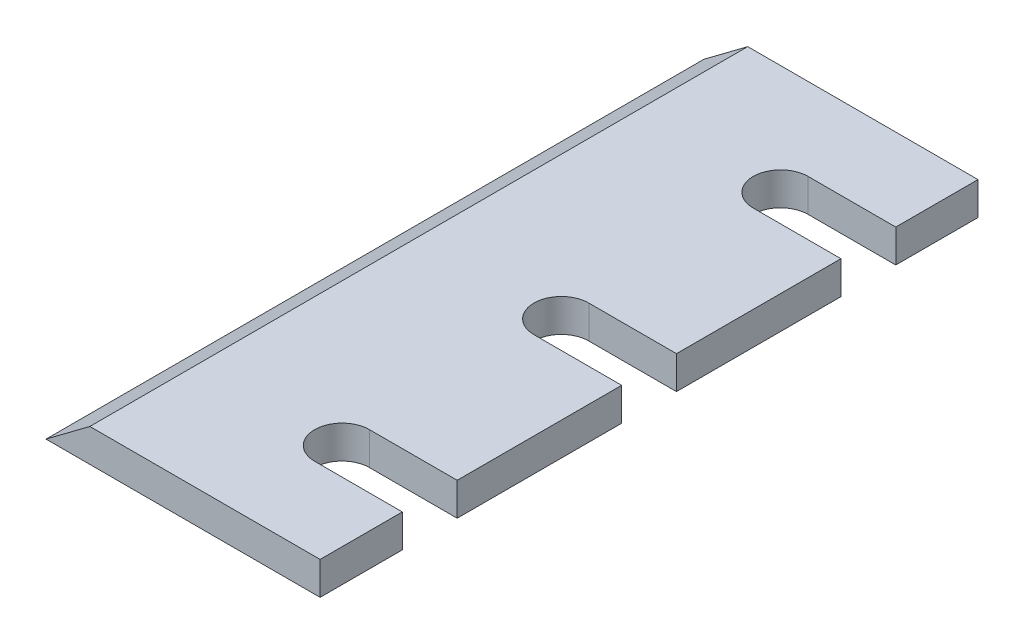
ISO-10303-21;
HEADER;
FILE_DESCRIPTION(('STEP AP214'),'2;1');
FILE_NAME('part.step','',(''),(''),'','','');
FILE_SCHEMA(('AUTOMOTIVE_DESIGN { 1 0 10303 214 1 1 1 1 }'));
ENDSEC;
DATA;
#1=APPLICATION_CONTEXT('core data for automotive mechanical design processes');
#2=APPLICATION_PROTOCOL_DEFINITION('international standard','automotive_design',2000,#1);
#3=PRODUCT_CONTEXT('',#1,'mechanical');
#4=PRODUCT('Part','Part','',(#3));
#5=PRODUCT_RELATED_PRODUCT_CATEGORY('part','',(#4));
#6=PRODUCT_DEFINITION_FORMATION('','',#4);
#7=PRODUCT_DEFINITION_CONTEXT('part definition',#1,'design');
#8=PRODUCT_DEFINITION('design','',#6,#7);
#9=PRODUCT_DEFINITION_SHAPE('','',#8);
#10=(LENGTH_UNIT() NAMED_UNIT(*) SI_UNIT(.MILLI.,.METRE.));
#11=(NAMED_UNIT(*) PLANE_ANGLE_UNIT() SI_UNIT($,.RADIAN.));
#12=(NAMED_UNIT(*) SI_UNIT($,.STERADIAN.) SOLID_ANGLE_UNIT());
#13=UNCERTAINTY_MEASURE_WITH_UNIT(LENGTH_MEASURE(1.E-05),#10,'distance_accuracy_value','');
#14=(GEOMETRIC_REPRESENTATION_CONTEXT(3) GLOBAL_UNCERTAINTY_ASSIGNED_CONTEXT((#13)) GLOBAL_UNIT_ASSIGNED_CONTEXT((#10,
#11,#12)) REPRESENTATION_CONTEXT('',''));
#15=CARTESIAN_POINT('',(0.,0.,0.));
#16=DIRECTION('',(0.,0.,1.));
#17=DIRECTION('',(1.,0.,0.));
#18=AXIS2_PLACEMENT_3D('',#15,#16,#17);
#19=CARTESIAN_POINT('',(25.,0.,60.));
#20=DIRECTION('',(-1.,0.,0.));
#21=DIRECTION('',(0.,0.,1.));
#22=AXIS2_PLACEMENT_3D('',#19,#20,#21);
#23=PLANE('',#22);
#24=DIRECTION('',(0.,0.,-1.));
#25=VECTOR('',#24,1.);
#26=CARTESIAN_POINT('',(25.,0.,60.));
#27=LINE('',#26,#25);
#28=CARTESIAN_POINT('',(25.,0.,27.5));
#29=VERTEX_POINT('',#28);
#30=CARTESIAN_POINT('',(25.,0.,12.5));
#31=VERTEX_POINT('',#30);
#32=EDGE_CURVE('E167',#29,#31,#27,.T.);
#33=ORIENTED_EDGE('',*,*,#32,.T.);
#34=DIRECTION('',(0.,1.,0.));
#35=VECTOR('',#34,1.);
#36=CARTESIAN_POINT('',(25.,0.,12.5));
#37=LINE('',#36,#35);
#38=CARTESIAN_POINT('',(25.,3.,12.5));
#39=VERTEX_POINT('',#38);
#40=EDGE_CURVE('E210',#31,#39,#37,.T.);
#41=ORIENTED_EDGE('',*,*,#40,.T.);
#42=DIRECTION('',(0.,0.,-1.));
#43=VECTOR('',#42,1.);
#44=CARTESIAN_POINT('',(25.,3.,60.));
#45=LINE('',#44,#43);
#46=CARTESIAN_POINT('',(25.,3.,27.5));
#47=VERTEX_POINT('',#46);
#48=EDGE_CURVE('E263',#47,#39,#45,.T.);
#49=ORIENTED_EDGE('',*,*,#48,.F.);
#50=DIRECTION('',(0.,1.,0.));
#51=VECTOR('',#50,1.);
#52=CARTESIAN_POINT('',(25.,0.,27.5));
#53=LINE('',#52,#51);
#54=EDGE_CURVE('E55',#29,#47,#53,.T.);
#55=ORIENTED_EDGE('',*,*,#54,.F.);
#56=EDGE_LOOP('',(#33,#41,#49,#55));
#57=FACE_BOUND('',#56,.T.);
#58=ADVANCED_FACE('F32',(#57),#23,.F.);
#59=CARTESIAN_POINT('',(25.,0.,47.5));
#60=VERTEX_POINT('',#59);
#61=CARTESIAN_POINT('',(25.,0.,32.5));
#62=VERTEX_POINT('',#61);
#63=EDGE_CURVE('E170',#60,#62,#27,.T.);
#64=ORIENTED_EDGE('',*,*,#63,.T.);
#65=DIRECTION('',(0.,1.,0.));
#66=VECTOR('',#65,1.);
#67=CARTESIAN_POINT('',(25.,0.,32.5));
#68=LINE('',#67,#66);
#69=CARTESIAN_POINT('',(25.,3.,32.5));
#70=VERTEX_POINT('',#69);
#71=EDGE_CURVE('E186',#62,#70,#68,.T.);
#72=ORIENTED_EDGE('',*,*,#71,.T.);
#73=CARTESIAN_POINT('',(25.,3.,47.5));
#74=VERTEX_POINT('',#73);
#75=EDGE_CURVE('E172',#74,#70,#45,.T.);
#76=ORIENTED_EDGE('',*,*,#75,.F.);
#77=DIRECTION('',(0.,1.,0.));
#78=VECTOR('',#77,1.);
#79=CARTESIAN_POINT('',(25.,0.,47.5));
#80=LINE('',#79,#78);
#81=EDGE_CURVE('E188',#60,#74,#80,.T.);
#82=ORIENTED_EDGE('',*,*,#81,.F.);
#83=EDGE_LOOP('',(#64,#72,#76,#82));
#84=FACE_BOUND('',#83,.T.);
#85=ADVANCED_FACE('F184',(#84),#23,.F.);
#86=CARTESIAN_POINT('',(25.,0.,60.));
#87=VERTEX_POINT('',#86);
#88=CARTESIAN_POINT('',(25.,0.,52.5));
#89=VERTEX_POINT('',#88);
#90=EDGE_CURVE('E40',#87,#89,#27,.T.);
#91=ORIENTED_EDGE('',*,*,#90,.T.);
#92=DIRECTION('',(0.,1.,0.));
#93=VECTOR('',#92,1.);
#94=CARTESIAN_POINT('',(25.,0.,52.5));
#95=LINE('',#94,#93);
#96=CARTESIAN_POINT('',(25.,3.,52.5));
#97=VERTEX_POINT('',#96);
#98=EDGE_CURVE('E233',#89,#97,#95,.T.);
#99=ORIENTED_EDGE('',*,*,#98,.T.);
#100=CARTESIAN_POINT('',(25.,3.,60.));
#101=VERTEX_POINT('',#100);
#102=EDGE_CURVE('E168',#101,#97,#45,.T.);
#103=ORIENTED_EDGE('',*,*,#102,.F.);
#104=DIRECTION('',(0.,1.,0.));
#105=VECTOR('',#104,1.);
#106=CARTESIAN_POINT('',(25.,0.,60.));
#107=LINE('',#106,#105);
#108=EDGE_CURVE('E247',#87,#101,#107,.T.);
#109=ORIENTED_EDGE('',*,*,#108,.F.);
#110=EDGE_LOOP('',(#91,#99,#103,#109));
#111=FACE_BOUND('',#110,.T.);
#112=ADVANCED_FACE('F283',(#111),#23,.F.);
#113=CARTESIAN_POINT('',(4.,3.,60.));
#114=DIRECTION('',(0.6,-0.8,0.));
#115=DIRECTION('',(0.8,0.6,0.));
#116=AXIS2_PLACEMENT_3D('',#113,#114,#115);
#117=PLANE('',#116);
#118=DIRECTION('',(-0.8,-0.6,0.));
#119=VECTOR('',#118,1.);
#120=CARTESIAN_POINT('',(4.,3.,0.));
#121=LINE('',#120,#119);
#122=CARTESIAN_POINT('',(4.,3.,0.));
#123=VERTEX_POINT('',#122);
#124=CARTESIAN_POINT('',(0.,0.,0.));
#125=VERTEX_POINT('',#124);
#126=EDGE_CURVE('E235',#123,#125,#121,.T.);
#127=ORIENTED_EDGE('',*,*,#126,.T.);
#128=DIRECTION('',(0.,0.,-1.));
#129=VECTOR('',#128,1.);
#130=CARTESIAN_POINT('',(0.,0.,60.));
#131=LINE('',#130,#129);
#132=CARTESIAN_POINT('',(0.,0.,60.));
#133=VERTEX_POINT('',#132);
#134=EDGE_CURVE('E11',#133,#125,#131,.T.);
#135=ORIENTED_EDGE('',*,*,#134,.F.);
#136=DIRECTION('',(-0.8,-0.6,0.));
#137=VECTOR('',#136,1.);
#138=CARTESIAN_POINT('',(4.,3.,60.));
#139=LINE('',#138,#137);
#140=CARTESIAN_POINT('',(4.,3.,60.));
#141=VERTEX_POINT('',#140);
#142=EDGE_CURVE('E241',#141,#133,#139,.T.);
#143=ORIENTED_EDGE('',*,*,#142,.F.);
#144=DIRECTION('',(0.,0.,-1.));
#145=VECTOR('',#144,1.);
#146=CARTESIAN_POINT('',(4.,3.,60.));
#147=LINE('',#146,#145);
#148=EDGE_CURVE('E251',#141,#123,#147,.T.);
#149=ORIENTED_EDGE('',*,*,#148,.T.);
#150=EDGE_LOOP('',(#127,#135,#143,#149));
#151=FACE_BOUND('',#150,.T.);
#152=ADVANCED_FACE('F34',(#151),#117,.F.);
#153=CARTESIAN_POINT('',(0.,0.,60.));
#154=DIRECTION('',(0.,1.,0.));
#155=DIRECTION('',(0.,0.,1.));
#156=AXIS2_PLACEMENT_3D('',#153,#154,#155);
#157=PLANE('',#156);
#158=CARTESIAN_POINT('',(17.,0.,10.));
#159=DIRECTION('',(0.,1.,0.));
#160=DIRECTION('',(1.,0.,0.));
#161=AXIS2_PLACEMENT_3D('',#158,#159,#160);
#162=CIRCLE('',#161,2.5);
#163=CARTESIAN_POINT('',(17.,0.,7.5));
#164=VERTEX_POINT('',#163);
#165=CARTESIAN_POINT('',(17.,0.,12.5));
#166=VERTEX_POINT('',#165);
#167=EDGE_CURVE('E152',#164,#166,#162,.T.);
#168=ORIENTED_EDGE('',*,*,#167,.T.);
#169=DIRECTION('',(1.,0.,0.));
#170=VECTOR('',#169,1.);
#171=CARTESIAN_POINT('',(25.,0.,12.5));
#172=LINE('',#171,#170);
#173=EDGE_CURVE('E162',#166,#31,#172,.T.);
#174=ORIENTED_EDGE('',*,*,#173,.T.);
#175=ORIENTED_EDGE('',*,*,#32,.F.);
#176=DIRECTION('',(-1.,0.,0.));
#177=VECTOR('',#176,1.);
#178=CARTESIAN_POINT('',(25.,0.,27.5));
#179=LINE('',#178,#177);
#180=CARTESIAN_POINT('',(17.,0.,27.5));
#181=VERTEX_POINT('',#180);
#182=EDGE_CURVE('E203',#29,#181,#179,.T.);
#183=ORIENTED_EDGE('',*,*,#182,.T.);
#184=CARTESIAN_POINT('',(17.,0.,30.));
#185=DIRECTION('',(0.,1.,0.));
#186=DIRECTION('',(1.,0.,0.));
#187=AXIS2_PLACEMENT_3D('',#184,#185,#186);
#188=CIRCLE('',#187,2.5);
#189=CARTESIAN_POINT('',(17.,0.,32.5));
#190=VERTEX_POINT('',#189);
#191=EDGE_CURVE('E198',#181,#190,#188,.T.);
#192=ORIENTED_EDGE('',*,*,#191,.T.);
#193=DIRECTION('',(1.,0.,0.));
#194=VECTOR('',#193,1.);
#195=CARTESIAN_POINT('',(25.,0.,32.5));
#196=LINE('',#195,#194);
#197=EDGE_CURVE('E195',#190,#62,#196,.T.);
#198=ORIENTED_EDGE('',*,*,#197,.T.);
#199=ORIENTED_EDGE('',*,*,#63,.F.);
#200=DIRECTION('',(-1.,0.,0.));
#201=VECTOR('',#200,1.);
#202=CARTESIAN_POINT('',(25.,0.,47.5));
#203=LINE('',#202,#201);
#204=CARTESIAN_POINT('',(17.,0.,47.5));
#205=VERTEX_POINT('',#204);
#206=EDGE_CURVE('E192',#60,#205,#203,.T.);
#207=ORIENTED_EDGE('',*,*,#206,.T.);
#208=CARTESIAN_POINT('',(17.,0.,50.));
#209=DIRECTION('',(0.,1.,0.));
#210=DIRECTION('',(1.,0.,0.));
#211=AXIS2_PLACEMENT_3D('',#208,#209,#210);
#212=CIRCLE('',#211,2.5);
#213=CARTESIAN_POINT('',(17.,0.,52.5));
#214=VERTEX_POINT('',#213);
#215=EDGE_CURVE('E221',#205,#214,#212,.T.);
#216=ORIENTED_EDGE('',*,*,#215,.T.);
#217=DIRECTION('',(1.,0.,0.));
#218=VECTOR('',#217,1.);
#219=CARTESIAN_POINT('',(25.,0.,52.5));
#220=LINE('',#219,#218);
#221=EDGE_CURVE('E224',#214,#89,#220,.T.);
#222=ORIENTED_EDGE('',*,*,#221,.T.);
#223=ORIENTED_EDGE('',*,*,#90,.F.);
#224=DIRECTION('',(1.,0.,0.));
#225=VECTOR('',#224,1.);
#226=CARTESIAN_POINT('',(0.,0.,60.));
#227=LINE('',#226,#225);
#228=EDGE_CURVE('E244',#133,#87,#227,.T.);
#229=ORIENTED_EDGE('',*,*,#228,.F.);
#230=ORIENTED_EDGE('',*,*,#134,.T.);
#231=DIRECTION('',(1.,0.,0.));
#232=VECTOR('',#231,1.);
#233=CARTESIAN_POINT('',(0.,0.,0.));
#234=LINE('',#233,#232);
#235=CARTESIAN_POINT('',(25.,0.,0.));
#236=VERTEX_POINT('',#235);
#237=EDGE_CURVE('E165',#125,#236,#234,.T.);
#238=ORIENTED_EDGE('',*,*,#237,.T.);
#239=CARTESIAN_POINT('',(25.,0.,7.5));
#240=VERTEX_POINT('',#239);
#241=EDGE_CURVE('E159',#240,#236,#27,.T.);
#242=ORIENTED_EDGE('',*,*,#241,.F.);
#243=DIRECTION('',(-1.,0.,0.));
#244=VECTOR('',#243,1.);
#245=CARTESIAN_POINT('',(25.,0.,7.5));
#246=LINE('',#245,#244);
#247=EDGE_CURVE('E145',#240,#164,#246,.T.);
#248=ORIENTED_EDGE('',*,*,#247,.T.);
#249=EDGE_LOOP('',(#168,#174,#175,#183,#192,#198,#199,#207,#216,#222,#223,#229,#230,#238,#242,#248));
#250=FACE_BOUND('',#249,.T.);
#251=ADVANCED_FACE('F164',(#250),#157,.F.);
#252=CARTESIAN_POINT('',(25.,3.,7.50000000000001));
#253=VERTEX_POINT('',#252);
#254=CARTESIAN_POINT('',(25.,3.,0.));
#255=VERTEX_POINT('',#254);
#256=EDGE_CURVE('E161',#253,#255,#45,.T.);
#257=ORIENTED_EDGE('',*,*,#256,.F.);
#258=DIRECTION('',(0.,1.,0.));
#259=VECTOR('',#258,1.);
#260=CARTESIAN_POINT('',(25.,0.,7.5));
#261=LINE('',#260,#259);
#262=EDGE_CURVE('E47',#240,#253,#261,.T.);
#263=ORIENTED_EDGE('',*,*,#262,.F.);
#264=ORIENTED_EDGE('',*,*,#241,.T.);
#265=DIRECTION('',(0.,1.,0.));
#266=VECTOR('',#265,1.);
#267=CARTESIAN_POINT('',(25.,0.,0.));
#268=LINE('',#267,#266);
#269=EDGE_CURVE('E255',#236,#255,#268,.T.);
#270=ORIENTED_EDGE('',*,*,#269,.T.);
#271=EDGE_LOOP('',(#257,#263,#264,#270));
#272=FACE_BOUND('',#271,.T.);
#273=ADVANCED_FACE('F157',(#272),#23,.F.);
#274=CARTESIAN_POINT('',(25.,3.,60.));
#275=DIRECTION('',(0.,-1.,0.));
#276=DIRECTION('',(1.,0.,0.));
#277=AXIS2_PLACEMENT_3D('',#274,#275,#276);
#278=PLANE('',#277);
#279=ORIENTED_EDGE('',*,*,#48,.T.);
#280=DIRECTION('',(1.,0.,0.));
#281=VECTOR('',#280,1.);
#282=CARTESIAN_POINT('',(25.,3.,12.5));
#283=LINE('',#282,#281);
#284=CARTESIAN_POINT('',(17.,3.,12.5));
#285=VERTEX_POINT('',#284);
#286=EDGE_CURVE('E153',#285,#39,#283,.T.);
#287=ORIENTED_EDGE('',*,*,#286,.F.);
#288=CARTESIAN_POINT('',(17.,3.,10.));
#289=DIRECTION('',(0.,1.,0.));
#290=DIRECTION('',(1.,0.,0.));
#291=AXIS2_PLACEMENT_3D('',#288,#289,#290);
#292=CIRCLE('',#291,2.5);
#293=CARTESIAN_POINT('',(17.,3.,7.5));
#294=VERTEX_POINT('',#293);
#295=EDGE_CURVE('E421',#294,#285,#292,.T.);
#296=ORIENTED_EDGE('',*,*,#295,.F.);
#297=DIRECTION('',(-1.,0.,0.));
#298=VECTOR('',#297,1.);
#299=CARTESIAN_POINT('',(25.,3.,7.5));
#300=LINE('',#299,#298);
#301=EDGE_CURVE('E424',#253,#294,#300,.T.);
#302=ORIENTED_EDGE('',*,*,#301,.F.);
#303=ORIENTED_EDGE('',*,*,#256,.T.);
#304=DIRECTION('',(-1.,0.,0.));
#305=VECTOR('',#304,1.);
#306=CARTESIAN_POINT('',(25.,3.,0.));
#307=LINE('',#306,#305);
#308=EDGE_CURVE('E245',#255,#123,#307,.T.);
#309=ORIENTED_EDGE('',*,*,#308,.T.);
#310=ORIENTED_EDGE('',*,*,#148,.F.);
#311=DIRECTION('',(-1.,0.,0.));
#312=VECTOR('',#311,1.);
#313=CARTESIAN_POINT('',(25.,3.,60.));
#314=LINE('',#313,#312);
#315=EDGE_CURVE('E249',#101,#141,#314,.T.);
#316=ORIENTED_EDGE('',*,*,#315,.F.);
#317=ORIENTED_EDGE('',*,*,#102,.T.);
#318=DIRECTION('',(1.,0.,0.));
#319=VECTOR('',#318,1.);
#320=CARTESIAN_POINT('',(25.,3.,52.5));
#321=LINE('',#320,#319);
#322=CARTESIAN_POINT('',(17.,3.,52.5));
#323=VERTEX_POINT('',#322);
#324=EDGE_CURVE('E222',#323,#97,#321,.T.);
#325=ORIENTED_EDGE('',*,*,#324,.F.);
#326=CARTESIAN_POINT('',(17.,3.,50.));
#327=DIRECTION('',(0.,1.,0.));
#328=DIRECTION('',(1.,0.,0.));
#329=AXIS2_PLACEMENT_3D('',#326,#327,#328);
#330=CIRCLE('',#329,2.5);
#331=CARTESIAN_POINT('',(17.,3.,47.5));
#332=VERTEX_POINT('',#331);
#333=EDGE_CURVE('E229',#332,#323,#330,.T.);
#334=ORIENTED_EDGE('',*,*,#333,.F.);
#335=DIRECTION('',(-1.,0.,0.));
#336=VECTOR('',#335,1.);
#337=CARTESIAN_POINT('',(25.,3.,47.5));
#338=LINE('',#337,#336);
#339=EDGE_CURVE('E216',#74,#332,#338,.T.);
#340=ORIENTED_EDGE('',*,*,#339,.F.);
#341=ORIENTED_EDGE('',*,*,#75,.T.);
#342=DIRECTION('',(1.,0.,0.));
#343=VECTOR('',#342,1.);
#344=CARTESIAN_POINT('',(25.,3.,32.5));
#345=LINE('',#344,#343);
#346=CARTESIAN_POINT('',(17.,3.,32.5));
#347=VERTEX_POINT('',#346);
#348=EDGE_CURVE('E213',#347,#70,#345,.T.);
#349=ORIENTED_EDGE('',*,*,#348,.F.);
#350=CARTESIAN_POINT('',(17.,3.,30.));
#351=DIRECTION('',(0.,1.,0.));
#352=DIRECTION('',(1.,0.,0.));
#353=AXIS2_PLACEMENT_3D('',#350,#351,#352);
#354=CIRCLE('',#353,2.5);
#355=CARTESIAN_POINT('',(17.,3.,27.5));
#356=VERTEX_POINT('',#355);
#357=EDGE_CURVE('E209',#356,#347,#354,.T.);
#358=ORIENTED_EDGE('',*,*,#357,.F.);
#359=DIRECTION('',(-1.,0.,0.));
#360=VECTOR('',#359,1.);
#361=CARTESIAN_POINT('',(25.,3.,27.5));
#362=LINE('',#361,#360);
#363=EDGE_CURVE('E207',#47,#356,#362,.T.);
#364=ORIENTED_EDGE('',*,*,#363,.F.);
#365=EDGE_LOOP('',(#279,#287,#296,#302,#303,#309,#310,#316,#317,#325,#334,#340,#341,#349,#358,#364));
#366=FACE_BOUND('',#365,.T.);
#367=ADVANCED_FACE('F270',(#366),#278,.F.);
#368=CARTESIAN_POINT('',(0.,0.,60.));
#369=DIRECTION('',(0.,0.,-1.));
#370=DIRECTION('',(-1.,0.,0.));
#371=AXIS2_PLACEMENT_3D('',#368,#369,#370);
#372=PLANE('',#371);
#373=ORIENTED_EDGE('',*,*,#142,.T.);
#374=ORIENTED_EDGE('',*,*,#228,.T.);
#375=ORIENTED_EDGE('',*,*,#108,.T.);
#376=ORIENTED_EDGE('',*,*,#315,.T.);
#377=EDGE_LOOP('',(#373,#374,#375,#376));
#378=FACE_BOUND('',#377,.T.);
#379=ADVANCED_FACE('F286',(#378),#372,.F.);
#380=CARTESIAN_POINT('',(0.,0.,0.));
#381=DIRECTION('',(0.,0.,-1.));
#382=DIRECTION('',(-1.,0.,0.));
#383=AXIS2_PLACEMENT_3D('',#380,#381,#382);
#384=PLANE('',#383);
#385=ORIENTED_EDGE('',*,*,#126,.F.);
#386=ORIENTED_EDGE('',*,*,#308,.F.);
#387=ORIENTED_EDGE('',*,*,#269,.F.);
#388=ORIENTED_EDGE('',*,*,#237,.F.);
#389=EDGE_LOOP('',(#385,#386,#387,#388));
#390=FACE_BOUND('',#389,.T.);
#391=ADVANCED_FACE('F290',(#390),#384,.T.);
#392=CARTESIAN_POINT('',(25.,0.,52.5));
#393=DIRECTION('',(0.,0.,1.));
#394=DIRECTION('',(1.,0.,0.));
#395=AXIS2_PLACEMENT_3D('',#392,#393,#394);
#396=PLANE('',#395);
#397=ORIENTED_EDGE('',*,*,#324,.T.);
#398=ORIENTED_EDGE('',*,*,#98,.F.);
#399=ORIENTED_EDGE('',*,*,#221,.F.);
#400=DIRECTION('',(0.,1.,0.));
#401=VECTOR('',#400,1.);
#402=CARTESIAN_POINT('',(17.,0.,52.5));
#403=LINE('',#402,#401);
#404=EDGE_CURVE('E236',#214,#323,#403,.T.);
#405=ORIENTED_EDGE('',*,*,#404,.T.);
#406=EDGE_LOOP('',(#397,#398,#399,#405));
#407=FACE_BOUND('',#406,.T.);
#408=ADVANCED_FACE('F281',(#407),#396,.F.);
#409=CARTESIAN_POINT('',(17.,0.,50.));
#410=DIRECTION('',(0.,1.,0.));
#411=DIRECTION('',(-1.,0.,0.));
#412=AXIS2_PLACEMENT_3D('',#409,#410,#411);
#413=CYLINDRICAL_SURFACE('',#412,2.5);
#414=ORIENTED_EDGE('',*,*,#333,.T.);
#415=ORIENTED_EDGE('',*,*,#404,.F.);
#416=ORIENTED_EDGE('',*,*,#215,.F.);
#417=DIRECTION('',(0.,1.,0.));
#418=VECTOR('',#417,1.);
#419=CARTESIAN_POINT('',(17.,0.,47.5));
#420=LINE('',#419,#418);
#421=EDGE_CURVE('E238',#205,#332,#420,.T.);
#422=ORIENTED_EDGE('',*,*,#421,.T.);
#423=EDGE_LOOP('',(#414,#415,#416,#422));
#424=FACE_BOUND('',#423,.T.);
#425=ADVANCED_FACE('F278',(#424),#413,.F.);
#426=CARTESIAN_POINT('',(25.,0.,47.5));
#427=DIRECTION('',(0.,0.,-1.));
#428=DIRECTION('',(-1.,0.,0.));
#429=AXIS2_PLACEMENT_3D('',#426,#427,#428);
#430=PLANE('',#429);
#431=ORIENTED_EDGE('',*,*,#339,.T.);
#432=ORIENTED_EDGE('',*,*,#421,.F.);
#433=ORIENTED_EDGE('',*,*,#206,.F.);
#434=ORIENTED_EDGE('',*,*,#81,.T.);
#435=EDGE_LOOP('',(#431,#432,#433,#434));
#436=FACE_BOUND('',#435,.T.);
#437=ADVANCED_FACE('F275',(#436),#430,.F.);
#438=CARTESIAN_POINT('',(25.,0.,32.5));
#439=DIRECTION('',(0.,0.,1.));
#440=DIRECTION('',(1.,0.,0.));
#441=AXIS2_PLACEMENT_3D('',#438,#439,#440);
#442=PLANE('',#441);
#443=ORIENTED_EDGE('',*,*,#348,.T.);
#444=ORIENTED_EDGE('',*,*,#71,.F.);
#445=ORIENTED_EDGE('',*,*,#197,.F.);
#446=DIRECTION('',(0.,1.,0.));
#447=VECTOR('',#446,1.);
#448=CARTESIAN_POINT('',(17.,0.,32.5));
#449=LINE('',#448,#447);
#450=EDGE_CURVE('E217',#190,#347,#449,.T.);
#451=ORIENTED_EDGE('',*,*,#450,.T.);
#452=EDGE_LOOP('',(#443,#444,#445,#451));
#453=FACE_BOUND('',#452,.T.);
#454=ADVANCED_FACE('F360',(#453),#442,.F.);
#455=CARTESIAN_POINT('',(17.,0.,30.));
#456=DIRECTION('',(0.,1.,0.));
#457=DIRECTION('',(-1.,0.,0.));
#458=AXIS2_PLACEMENT_3D('',#455,#456,#457);
#459=CYLINDRICAL_SURFACE('',#458,2.5);
#460=ORIENTED_EDGE('',*,*,#357,.T.);
#461=ORIENTED_EDGE('',*,*,#450,.F.);
#462=ORIENTED_EDGE('',*,*,#191,.F.);
#463=DIRECTION('',(0.,1.,0.));
#464=VECTOR('',#463,1.);
#465=CARTESIAN_POINT('',(17.,0.,27.5));
#466=LINE('',#465,#464);
#467=EDGE_CURVE('E201',#181,#356,#466,.T.);
#468=ORIENTED_EDGE('',*,*,#467,.T.);
#469=EDGE_LOOP('',(#460,#461,#462,#468));
#470=FACE_BOUND('',#469,.T.);
#471=ADVANCED_FACE('F369',(#470),#459,.F.);
#472=CARTESIAN_POINT('',(25.,0.,27.5));
#473=DIRECTION('',(0.,0.,-1.));
#474=DIRECTION('',(-1.,0.,0.));
#475=AXIS2_PLACEMENT_3D('',#472,#473,#474);
#476=PLANE('',#475);
#477=ORIENTED_EDGE('',*,*,#363,.T.);
#478=ORIENTED_EDGE('',*,*,#467,.F.);
#479=ORIENTED_EDGE('',*,*,#182,.F.);
#480=ORIENTED_EDGE('',*,*,#54,.T.);
#481=EDGE_LOOP('',(#477,#478,#479,#480));
#482=FACE_BOUND('',#481,.T.);
#483=ADVANCED_FACE('F378',(#482),#476,.F.);
#484=CARTESIAN_POINT('',(25.,0.,12.5));
#485=DIRECTION('',(0.,0.,1.));
#486=DIRECTION('',(1.,0.,0.));
#487=AXIS2_PLACEMENT_3D('',#484,#485,#486);
#488=PLANE('',#487);
#489=ORIENTED_EDGE('',*,*,#286,.T.);
#490=ORIENTED_EDGE('',*,*,#40,.F.);
#491=ORIENTED_EDGE('',*,*,#173,.F.);
#492=DIRECTION('',(0.,1.,0.));
#493=VECTOR('',#492,1.);
#494=CARTESIAN_POINT('',(17.,0.,12.5));
#495=LINE('',#494,#493);
#496=EDGE_CURVE('E422',#166,#285,#495,.T.);
#497=ORIENTED_EDGE('',*,*,#496,.T.);
#498=EDGE_LOOP('',(#489,#490,#491,#497));
#499=FACE_BOUND('',#498,.T.);
#500=ADVANCED_FACE('F388',(#499),#488,.F.);
#501=CARTESIAN_POINT('',(17.,0.,10.));
#502=DIRECTION('',(0.,1.,0.));
#503=DIRECTION('',(-1.,0.,0.));
#504=AXIS2_PLACEMENT_3D('',#501,#502,#503);
#505=CYLINDRICAL_SURFACE('',#504,2.5);
#506=ORIENTED_EDGE('',*,*,#295,.T.);
#507=ORIENTED_EDGE('',*,*,#496,.F.);
#508=ORIENTED_EDGE('',*,*,#167,.F.);
#509=DIRECTION('',(0.,1.,0.));
#510=VECTOR('',#509,1.);
#511=CARTESIAN_POINT('',(17.,0.,7.5));
#512=LINE('',#511,#510);
#513=EDGE_CURVE('E147',#164,#294,#512,.T.);
#514=ORIENTED_EDGE('',*,*,#513,.T.);
#515=EDGE_LOOP('',(#506,#507,#508,#514));
#516=FACE_BOUND('',#515,.T.);
#517=ADVANCED_FACE('F397',(#516),#505,.F.);
#518=CARTESIAN_POINT('',(25.,0.,7.5));
#519=DIRECTION('',(0.,0.,-1.));
#520=DIRECTION('',(-1.,0.,0.));
#521=AXIS2_PLACEMENT_3D('',#518,#519,#520);
#522=PLANE('',#521);
#523=ORIENTED_EDGE('',*,*,#301,.T.);
#524=ORIENTED_EDGE('',*,*,#513,.F.);
#525=ORIENTED_EDGE('',*,*,#247,.F.);
#526=ORIENTED_EDGE('',*,*,#262,.T.);
#527=EDGE_LOOP('',(#523,#524,#525,#526));
#528=FACE_BOUND('',#527,.T.);
#529=ADVANCED_FACE('F146',(#528),#522,.F.);
#530=CLOSED_SHELL('',(#58,#85,#112,#152,#251,#273,#367,#379,#391,#408,#425,#437,#454,#471,#483,
#500,#517,#529));
#531=MANIFOLD_SOLID_BREP('B2',#530);
#532=ADVANCED_BREP_SHAPE_REPRESENTATION('',(#18,#531),#14);
#533=SHAPE_DEFINITION_REPRESENTATION(#9,#532);
ENDSEC;
END-ISO-10303-21;
